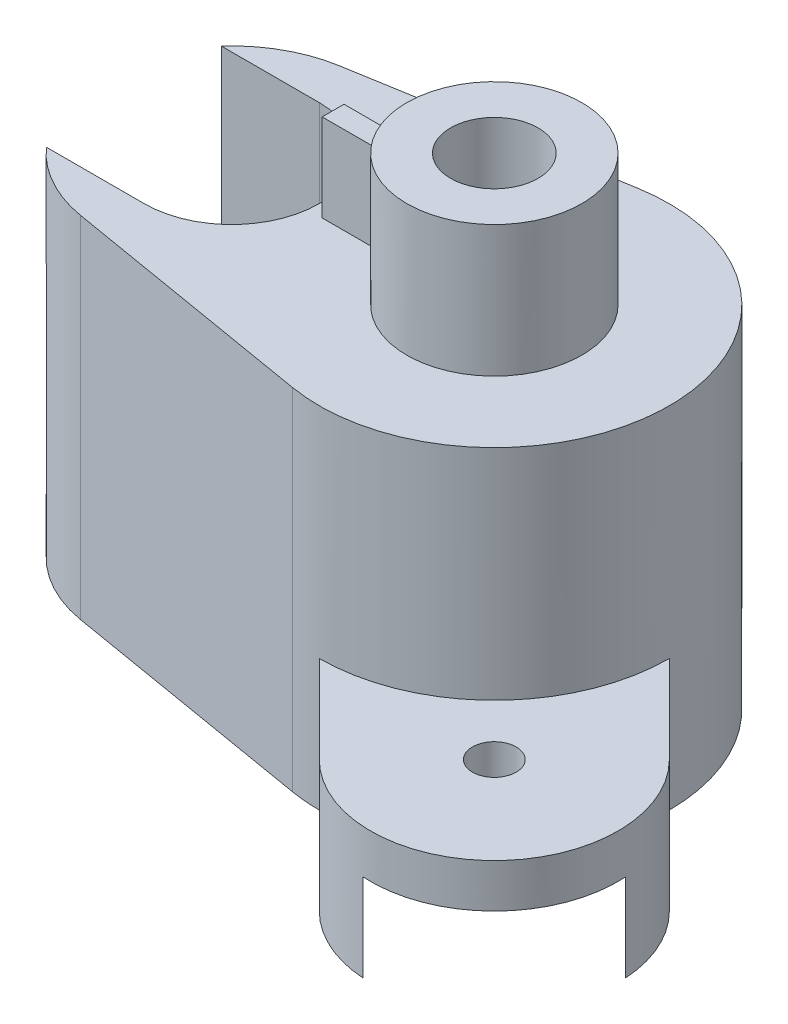
ISO-10303-21;
HEADER;
FILE_DESCRIPTION(('STEP AP214'),'2;1');
FILE_NAME('part.step','',(''),(''),'','','');
FILE_SCHEMA(('AUTOMOTIVE_DESIGN { 1 0 10303 214 1 1 1 1 }'));
ENDSEC;
DATA;
#1=APPLICATION_CONTEXT('core data for automotive mechanical design processes');
#2=APPLICATION_PROTOCOL_DEFINITION('international standard','automotive_design',2000,#1);
#3=PRODUCT_CONTEXT('',#1,'mechanical');
#4=PRODUCT('Part','Part','',(#3));
#5=PRODUCT_RELATED_PRODUCT_CATEGORY('part','',(#4));
#6=PRODUCT_DEFINITION_FORMATION('','',#4);
#7=PRODUCT_DEFINITION_CONTEXT('part definition',#1,'design');
#8=PRODUCT_DEFINITION('design','',#6,#7);
#9=PRODUCT_DEFINITION_SHAPE('','',#8);
#10=(LENGTH_UNIT() NAMED_UNIT(*) SI_UNIT(.MILLI.,.METRE.));
#11=(NAMED_UNIT(*) PLANE_ANGLE_UNIT() SI_UNIT($,.RADIAN.));
#12=(NAMED_UNIT(*) SI_UNIT($,.STERADIAN.) SOLID_ANGLE_UNIT());
#13=UNCERTAINTY_MEASURE_WITH_UNIT(LENGTH_MEASURE(1.E-05),#10,'distance_accuracy_value','');
#14=(GEOMETRIC_REPRESENTATION_CONTEXT(3) GLOBAL_UNCERTAINTY_ASSIGNED_CONTEXT((#13)) GLOBAL_UNIT_ASSIGNED_CONTEXT((#10,
#11,#12)) REPRESENTATION_CONTEXT('',''));
#15=CARTESIAN_POINT('',(0.,0.,0.));
#16=DIRECTION('',(0.,0.,1.));
#17=DIRECTION('',(1.,0.,0.));
#18=AXIS2_PLACEMENT_3D('',#15,#16,#17);
#19=CARTESIAN_POINT('',(0.,80.,0.));
#20=DIRECTION('',(0.,1.,0.));
#21=DIRECTION('',(0.,0.,1.));
#22=AXIS2_PLACEMENT_3D('',#19,#20,#21);
#23=PLANE('',#22);
#24=CARTESIAN_POINT('',(-60.,80.,0.));
#25=DIRECTION('',(0.,1.,0.));
#26=DIRECTION('',(0.,0.,1.));
#27=AXIS2_PLACEMENT_3D('',#24,#25,#26);
#28=CIRCLE('',#27,20.);
#29=CARTESIAN_POINT('',(-60.,80.,-20.));
#30=VERTEX_POINT('',#29);
#31=CARTESIAN_POINT('',(-60.,80.,20.));
#32=VERTEX_POINT('',#31);
#33=EDGE_CURVE('E264',#30,#32,#28,.F.);
#34=ORIENTED_EDGE('',*,*,#33,.T.);
#35=DIRECTION('',(-1.,0.,0.));
#36=VECTOR('',#35,1.);
#37=CARTESIAN_POINT('',(0.,80.,20.));
#38=LINE('',#37,#36);
#39=CARTESIAN_POINT('',(-82.3606797749978,80.,20.));
#40=VERTEX_POINT('',#39);
#41=EDGE_CURVE('E276',#32,#40,#38,.T.);
#42=ORIENTED_EDGE('',*,*,#41,.T.);
#43=CARTESIAN_POINT('',(-60.,80.,0.));
#44=DIRECTION('',(0.,1.,0.));
#45=DIRECTION('',(0.,0.,-1.));
#46=AXIS2_PLACEMENT_3D('',#43,#44,#45);
#47=CIRCLE('',#46,29.9999999999999);
#48=CARTESIAN_POINT('',(-65.,80.,29.5803989154981));
#49=VERTEX_POINT('',#48);
#50=EDGE_CURVE('E326',#40,#49,#47,.T.);
#51=ORIENTED_EDGE('',*,*,#50,.T.);
#52=DIRECTION('',(0.986013297183269,0.,0.166666666666667));
#53=VECTOR('',#52,1.);
#54=CARTESIAN_POINT('',(-65.,80.,29.5803989154981));
#55=LINE('',#54,#53);
#56=CARTESIAN_POINT('',(-6.66666666666666,80.,39.4405318873308));
#57=VERTEX_POINT('',#56);
#58=EDGE_CURVE('E330',#49,#57,#55,.T.);
#59=ORIENTED_EDGE('',*,*,#58,.T.);
#60=CARTESIAN_POINT('',(0.,80.,0.));
#61=DIRECTION('',(0.,1.,0.));
#62=DIRECTION('',(0.,0.,1.));
#63=AXIS2_PLACEMENT_3D('',#60,#61,#62);
#64=CIRCLE('',#63,40.);
#65=CARTESIAN_POINT('',(-6.66666666666667,80.,-39.4405318873308));
#66=VERTEX_POINT('',#65);
#67=EDGE_CURVE('E320',#57,#66,#64,.T.);
#68=ORIENTED_EDGE('',*,*,#67,.T.);
#69=DIRECTION('',(-0.986013297183269,0.,0.166666666666667));
#70=VECTOR('',#69,1.);
#71=CARTESIAN_POINT('',(-6.66666666666667,80.,-39.4405318873308));
#72=LINE('',#71,#70);
#73=CARTESIAN_POINT('',(-65.,80.,-29.5803989154981));
#74=VERTEX_POINT('',#73);
#75=EDGE_CURVE('E323',#66,#74,#72,.T.);
#76=ORIENTED_EDGE('',*,*,#75,.T.);
#77=CARTESIAN_POINT('',(-82.3606797749979,80.,-20.));
#78=VERTEX_POINT('',#77);
#79=EDGE_CURVE('E327',#74,#78,#47,.T.);
#80=ORIENTED_EDGE('',*,*,#79,.T.);
#81=DIRECTION('',(-1.,0.,0.));
#82=VECTOR('',#81,1.);
#83=CARTESIAN_POINT('',(0.,80.,-20.));
#84=LINE('',#83,#82);
#85=EDGE_CURVE('E289',#30,#78,#84,.T.);
#86=ORIENTED_EDGE('',*,*,#85,.F.);
#87=EDGE_LOOP('',(#34,#42,#51,#59,#68,#76,#80,#86));
#88=FACE_BOUND('',#87,.T.);
#89=DIRECTION('',(0.,0.,1.));
#90=VECTOR('',#89,1.);
#91=CARTESIAN_POINT('',(-36.8431348329844,80.,-2.5));
#92=LINE('',#91,#90);
#93=CARTESIAN_POINT('',(-36.8431348329844,80.,-2.5));
#94=VERTEX_POINT('',#93);
#95=CARTESIAN_POINT('',(-36.8431348329844,80.,2.5));
#96=VERTEX_POINT('',#95);
#97=EDGE_CURVE('E50',#94,#96,#92,.T.);
#98=ORIENTED_EDGE('',*,*,#97,.F.);
#99=DIRECTION('',(-1.,0.,0.));
#100=VECTOR('',#99,1.);
#101=CARTESIAN_POINT('',(-19.8431348329844,80.,-2.49999999999999));
#102=LINE('',#101,#100);
#103=CARTESIAN_POINT('',(-19.8431348329844,80.,-2.49999999999999));
#104=VERTEX_POINT('',#103);
#105=EDGE_CURVE('E200',#104,#94,#102,.T.);
#106=ORIENTED_EDGE('',*,*,#105,.F.);
#107=CARTESIAN_POINT('',(0.,80.,0.));
#108=DIRECTION('',(0.,1.,0.));
#109=DIRECTION('',(0.,0.,1.));
#110=AXIS2_PLACEMENT_3D('',#107,#108,#109);
#111=CIRCLE('',#110,20.);
#112=CARTESIAN_POINT('',(-19.8431348329844,80.,2.5));
#113=VERTEX_POINT('',#112);
#114=EDGE_CURVE('E177',#113,#104,#111,.T.);
#115=ORIENTED_EDGE('',*,*,#114,.F.);
#116=DIRECTION('',(1.,0.,0.));
#117=VECTOR('',#116,1.);
#118=CARTESIAN_POINT('',(-19.8431348329844,80.,2.5));
#119=LINE('',#118,#117);
#120=EDGE_CURVE('E55',#96,#113,#119,.T.);
#121=ORIENTED_EDGE('',*,*,#120,.F.);
#122=EDGE_LOOP('',(#98,#106,#115,#121));
#123=FACE_BOUND('',#122,.T.);
#124=ADVANCED_FACE('F35',(#88,#123),#23,.T.);
#125=CARTESIAN_POINT('',(0.,110.,0.));
#126=DIRECTION('',(0.,-1.,0.));
#127=DIRECTION('',(0.,0.,-1.));
#128=AXIS2_PLACEMENT_3D('',#125,#126,#127);
#129=CYLINDRICAL_SURFACE('',#128,20.);
#130=CARTESIAN_POINT('',(0.,110.,0.));
#131=DIRECTION('',(0.,1.,0.));
#132=DIRECTION('',(0.,0.,1.));
#133=AXIS2_PLACEMENT_3D('',#130,#131,#132);
#134=CIRCLE('',#133,20.);
#135=CARTESIAN_POINT('',(0.,110.,20.));
#136=VERTEX_POINT('',#135);
#137=EDGE_CURVE('E309',#136,#136,#134,.T.);
#138=ORIENTED_EDGE('',*,*,#137,.F.);
#139=EDGE_LOOP('',(#138));
#140=FACE_BOUND('',#139,.T.);
#141=DIRECTION('',(0.,-1.,0.));
#142=VECTOR('',#141,1.);
#143=CARTESIAN_POINT('',(-19.8431348329844,100.,-2.49999999999999));
#144=LINE('',#143,#142);
#145=CARTESIAN_POINT('',(-19.8431348329844,100.,-2.49999999999999));
#146=VERTEX_POINT('',#145);
#147=EDGE_CURVE('E174',#146,#104,#144,.T.);
#148=ORIENTED_EDGE('',*,*,#147,.F.);
#149=CARTESIAN_POINT('',(0.,100.,0.));
#150=DIRECTION('',(0.,-1.,0.));
#151=DIRECTION('',(0.,0.,-1.));
#152=AXIS2_PLACEMENT_3D('',#149,#150,#151);
#153=CIRCLE('',#152,20.);
#154=CARTESIAN_POINT('',(-19.8431348329844,100.,2.5));
#155=VERTEX_POINT('',#154);
#156=EDGE_CURVE('E11',#155,#146,#153,.T.);
#157=ORIENTED_EDGE('',*,*,#156,.F.);
#158=DIRECTION('',(0.,-1.,0.));
#159=VECTOR('',#158,1.);
#160=CARTESIAN_POINT('',(-19.8431348329844,100.,2.5));
#161=LINE('',#160,#159);
#162=EDGE_CURVE('E199',#155,#113,#161,.T.);
#163=ORIENTED_EDGE('',*,*,#162,.T.);
#164=ORIENTED_EDGE('',*,*,#114,.T.);
#165=EDGE_LOOP('',(#148,#157,#163,#164));
#166=FACE_BOUND('',#165,.T.);
#167=ADVANCED_FACE('F175',(#140,#166),#129,.T.);
#168=CARTESIAN_POINT('',(0.,0.,0.));
#169=DIRECTION('',(0.,1.,0.));
#170=DIRECTION('',(0.,0.,1.));
#171=AXIS2_PLACEMENT_3D('',#168,#169,#170);
#172=PLANE('',#171);
#173=CARTESIAN_POINT('',(-60.,0.,0.));
#174=DIRECTION('',(0.,1.,0.));
#175=DIRECTION('',(0.,0.,1.));
#176=AXIS2_PLACEMENT_3D('',#173,#174,#175);
#177=CIRCLE('',#176,10.);
#178=CARTESIAN_POINT('',(-60.,0.,9.99999999999997));
#179=VERTEX_POINT('',#178);
#180=EDGE_CURVE('E296',#179,#179,#177,.T.);
#181=ORIENTED_EDGE('',*,*,#180,.T.);
#182=EDGE_LOOP('',(#181));
#183=FACE_BOUND('',#182,.T.);
#184=DIRECTION('',(-0.707106781186542,0.,-0.707106781186554));
#185=VECTOR('',#184,1.);
#186=CARTESIAN_POINT('',(15.0000000000002,0.,-15.));
#187=LINE('',#186,#185);
#188=CARTESIAN_POINT('',(68.228756555323,0.,38.2287565553237));
#189=VERTEX_POINT('',#188);
#190=CARTESIAN_POINT('',(30.,0.,0.));
#191=VERTEX_POINT('',#190);
#192=EDGE_CURVE('E180',#189,#191,#187,.T.);
#193=ORIENTED_EDGE('',*,*,#192,.T.);
#194=CARTESIAN_POINT('',(0.,0.,0.));
#195=DIRECTION('',(0.,-1.,0.));
#196=DIRECTION('',(0.,0.,-1.));
#197=AXIS2_PLACEMENT_3D('',#194,#195,#196);
#198=CIRCLE('',#197,30.);
#199=CARTESIAN_POINT('',(0.,0.,30.));
#200=VERTEX_POINT('',#199);
#201=EDGE_CURVE('E312',#200,#191,#198,.T.);
#202=ORIENTED_EDGE('',*,*,#201,.F.);
#203=DIRECTION('',(-0.707106781186541,0.,-0.707106781186554));
#204=VECTOR('',#203,1.);
#205=CARTESIAN_POINT('',(-15.,0.,14.9999999999997));
#206=LINE('',#205,#204);
#207=CARTESIAN_POINT('',(38.2287565553218,0.,68.2287565553225));
#208=VERTEX_POINT('',#207);
#209=EDGE_CURVE('E211',#208,#200,#206,.T.);
#210=ORIENTED_EDGE('',*,*,#209,.F.);
#211=CARTESIAN_POINT('',(40.,0.,39.9999999999996));
#212=DIRECTION('',(0.,-1.,0.));
#213=DIRECTION('',(0.,0.,-1.));
#214=AXIS2_PLACEMENT_3D('',#211,#212,#213);
#215=CIRCLE('',#214,28.2842712474619);
#216=CARTESIAN_POINT('',(20.0000000000001,0.,59.9999999999999));
#217=VERTEX_POINT('',#216);
#218=EDGE_CURVE('E255',#208,#217,#215,.T.);
#219=ORIENTED_EDGE('',*,*,#218,.T.);
#220=DIRECTION('',(0.707106781186551,0.,0.707106781186544));
#221=VECTOR('',#220,1.);
#222=CARTESIAN_POINT('',(-20.,0.,20.0000000000002));
#223=LINE('',#222,#221);
#224=CARTESIAN_POINT('',(0.,0.,40.));
#225=VERTEX_POINT('',#224);
#226=EDGE_CURVE('E244',#225,#217,#223,.T.);
#227=ORIENTED_EDGE('',*,*,#226,.F.);
#228=CARTESIAN_POINT('',(0.,0.,0.));
#229=DIRECTION('',(0.,1.,0.));
#230=DIRECTION('',(0.,0.,1.));
#231=AXIS2_PLACEMENT_3D('',#228,#229,#230);
#232=CIRCLE('',#231,40.);
#233=CARTESIAN_POINT('',(-6.66666666666666,0.,39.4405318873308));
#234=VERTEX_POINT('',#233);
#235=EDGE_CURVE('E324',#234,#225,#232,.T.);
#236=ORIENTED_EDGE('',*,*,#235,.F.);
#237=DIRECTION('',(0.986013297183269,0.,0.166666666666667));
#238=VECTOR('',#237,1.);
#239=CARTESIAN_POINT('',(-65.,0.,29.5803989154981));
#240=LINE('',#239,#238);
#241=CARTESIAN_POINT('',(-65.,0.,29.5803989154981));
#242=VERTEX_POINT('',#241);
#243=EDGE_CURVE('E338',#242,#234,#240,.T.);
#244=ORIENTED_EDGE('',*,*,#243,.F.);
#245=CARTESIAN_POINT('',(-60.,0.,0.));
#246=DIRECTION('',(0.,1.,0.));
#247=DIRECTION('',(0.,0.,1.));
#248=AXIS2_PLACEMENT_3D('',#245,#246,#247);
#249=CIRCLE('',#248,30.);
#250=CARTESIAN_POINT('',(-65.,0.,-29.5803989154981));
#251=VERTEX_POINT('',#250);
#252=EDGE_CURVE('E336',#251,#242,#249,.T.);
#253=ORIENTED_EDGE('',*,*,#252,.F.);
#254=DIRECTION('',(-0.986013297183269,0.,0.166666666666667));
#255=VECTOR('',#254,1.);
#256=CARTESIAN_POINT('',(-6.66666666666667,0.,-39.4405318873308));
#257=LINE('',#256,#255);
#258=CARTESIAN_POINT('',(-6.66666666666667,0.,-39.4405318873308));
#259=VERTEX_POINT('',#258);
#260=EDGE_CURVE('E317',#259,#251,#257,.T.);
#261=ORIENTED_EDGE('',*,*,#260,.F.);
#262=CARTESIAN_POINT('',(40.,0.,0.));
#263=VERTEX_POINT('',#262);
#264=EDGE_CURVE('E341',#263,#259,#232,.T.);
#265=ORIENTED_EDGE('',*,*,#264,.F.);
#266=DIRECTION('',(0.707106781186551,0.,0.707106781186544));
#267=VECTOR('',#266,1.);
#268=CARTESIAN_POINT('',(19.9999999999998,0.,-20.));
#269=LINE('',#268,#267);
#270=CARTESIAN_POINT('',(59.9999999999999,0.,19.9999999999997));
#271=VERTEX_POINT('',#270);
#272=EDGE_CURVE('E239',#263,#271,#269,.T.);
#273=ORIENTED_EDGE('',*,*,#272,.T.);
#274=EDGE_CURVE('E256',#271,#189,#215,.T.);
#275=ORIENTED_EDGE('',*,*,#274,.T.);
#276=EDGE_LOOP('',(#193,#202,#210,#219,#227,#236,#244,#253,#261,#265,#273,#275));
#277=FACE_BOUND('',#276,.T.);
#278=ADVANCED_FACE('F355',(#183,#277),#172,.F.);
#279=CARTESIAN_POINT('',(0.,30.,0.));
#280=DIRECTION('',(0.,-1.,0.));
#281=DIRECTION('',(0.,0.,-1.));
#282=AXIS2_PLACEMENT_3D('',#279,#280,#281);
#283=CYLINDRICAL_SURFACE('',#282,30.);
#284=CARTESIAN_POINT('',(0.,30.,0.));
#285=DIRECTION('',(0.,-1.,0.));
#286=DIRECTION('',(0.,0.,-1.));
#287=AXIS2_PLACEMENT_3D('',#284,#285,#286);
#288=CIRCLE('',#287,30.);
#289=CARTESIAN_POINT('',(0.,30.,-30.));
#290=VERTEX_POINT('',#289);
#291=EDGE_CURVE('E314',#290,#290,#288,.T.);
#292=ORIENTED_EDGE('',*,*,#291,.F.);
#293=EDGE_LOOP('',(#292));
#294=FACE_BOUND('',#293,.T.);
#295=DIRECTION('',(0.,-1.,0.));
#296=VECTOR('',#295,1.);
#297=CARTESIAN_POINT('',(30.,20.,0.));
#298=LINE('',#297,#296);
#299=CARTESIAN_POINT('',(30.,20.,0.));
#300=VERTEX_POINT('',#299);
#301=EDGE_CURVE('E227',#300,#191,#298,.T.);
#302=ORIENTED_EDGE('',*,*,#301,.F.);
#303=CARTESIAN_POINT('',(0.,20.,0.));
#304=DIRECTION('',(0.,-1.,0.));
#305=DIRECTION('',(0.,0.,-1.));
#306=AXIS2_PLACEMENT_3D('',#303,#304,#305);
#307=CIRCLE('',#306,30.);
#308=CARTESIAN_POINT('',(0.,20.,30.));
#309=VERTEX_POINT('',#308);
#310=EDGE_CURVE('E217',#309,#300,#307,.F.);
#311=ORIENTED_EDGE('',*,*,#310,.F.);
#312=DIRECTION('',(0.,-1.,0.));
#313=VECTOR('',#312,1.);
#314=CARTESIAN_POINT('',(0.,20.,30.));
#315=LINE('',#314,#313);
#316=EDGE_CURVE('E230',#309,#200,#315,.T.);
#317=ORIENTED_EDGE('',*,*,#316,.T.);
#318=ORIENTED_EDGE('',*,*,#201,.T.);
#319=EDGE_LOOP('',(#302,#311,#317,#318));
#320=FACE_BOUND('',#319,.T.);
#321=ADVANCED_FACE('F393',(#294,#320),#283,.F.);
#322=CARTESIAN_POINT('',(40.,30.,39.9999999999996));
#323=DIRECTION('',(0.,-1.,0.));
#324=DIRECTION('',(0.,0.,-1.));
#325=AXIS2_PLACEMENT_3D('',#322,#323,#324);
#326=CYLINDRICAL_SURFACE('',#325,28.2842712474619);
#327=CARTESIAN_POINT('',(40.,20.,39.9999999999996));
#328=DIRECTION('',(0.,-1.,0.));
#329=DIRECTION('',(0.,0.,-1.));
#330=AXIS2_PLACEMENT_3D('',#327,#328,#329);
#331=CIRCLE('',#330,28.2842712474619);
#332=CARTESIAN_POINT('',(68.228756555323,20.,38.2287565553237));
#333=VERTEX_POINT('',#332);
#334=CARTESIAN_POINT('',(38.2287565553218,20.,68.2287565553225));
#335=VERTEX_POINT('',#334);
#336=EDGE_CURVE('E210',#333,#335,#331,.T.);
#337=ORIENTED_EDGE('',*,*,#336,.F.);
#338=DIRECTION('',(0.,-1.,0.));
#339=VECTOR('',#338,1.);
#340=CARTESIAN_POINT('',(68.228756555323,20.,38.2287565553237));
#341=LINE('',#340,#339);
#342=EDGE_CURVE('E223',#333,#189,#341,.T.);
#343=ORIENTED_EDGE('',*,*,#342,.T.);
#344=ORIENTED_EDGE('',*,*,#274,.F.);
#345=DIRECTION('',(0.,-1.,0.));
#346=VECTOR('',#345,1.);
#347=CARTESIAN_POINT('',(59.9999999999999,30.,19.9999999999997));
#348=LINE('',#347,#346);
#349=CARTESIAN_POINT('',(59.9999999999999,30.,19.9999999999997));
#350=VERTEX_POINT('',#349);
#351=EDGE_CURVE('E252',#350,#271,#348,.T.);
#352=ORIENTED_EDGE('',*,*,#351,.F.);
#353=CARTESIAN_POINT('',(40.,30.,39.9999999999996));
#354=DIRECTION('',(0.,-1.,0.));
#355=DIRECTION('',(0.,0.,-1.));
#356=AXIS2_PLACEMENT_3D('',#353,#354,#355);
#357=CIRCLE('',#356,28.2842712474619);
#358=CARTESIAN_POINT('',(20.0000000000001,30.,59.9999999999999));
#359=VERTEX_POINT('',#358);
#360=EDGE_CURVE('E243',#350,#359,#357,.T.);
#361=ORIENTED_EDGE('',*,*,#360,.T.);
#362=DIRECTION('',(0.,-1.,0.));
#363=VECTOR('',#362,1.);
#364=CARTESIAN_POINT('',(20.0000000000001,30.,59.9999999999999));
#365=LINE('',#364,#363);
#366=EDGE_CURVE('E268',#359,#217,#365,.T.);
#367=ORIENTED_EDGE('',*,*,#366,.T.);
#368=ORIENTED_EDGE('',*,*,#218,.F.);
#369=DIRECTION('',(0.,-1.,0.));
#370=VECTOR('',#369,1.);
#371=CARTESIAN_POINT('',(38.2287565553218,20.,68.2287565553225));
#372=LINE('',#371,#370);
#373=EDGE_CURVE('E233',#335,#208,#372,.T.);
#374=ORIENTED_EDGE('',*,*,#373,.F.);
#375=EDGE_LOOP('',(#337,#343,#344,#352,#361,#367,#368,#374));
#376=FACE_BOUND('',#375,.T.);
#377=ADVANCED_FACE('F411',(#376),#326,.T.);
#378=CARTESIAN_POINT('',(40.,30.,39.9999999999996));
#379=DIRECTION('',(0.,-1.,0.));
#380=DIRECTION('',(0.,0.,-1.));
#381=AXIS2_PLACEMENT_3D('',#378,#379,#380);
#382=CYLINDRICAL_SURFACE('',#381,5.);
#383=CARTESIAN_POINT('',(40.,30.,39.9999999999996));
#384=DIRECTION('',(0.,-1.,0.));
#385=DIRECTION('',(0.,0.,-1.));
#386=AXIS2_PLACEMENT_3D('',#383,#384,#385);
#387=CIRCLE('',#386,5.);
#388=CARTESIAN_POINT('',(40.,30.,34.9999999999996));
#389=VERTEX_POINT('',#388);
#390=EDGE_CURVE('E229',#389,#389,#387,.T.);
#391=ORIENTED_EDGE('',*,*,#390,.F.);
#392=EDGE_LOOP('',(#391));
#393=FACE_BOUND('',#392,.T.);
#394=CARTESIAN_POINT('',(40.,20.,39.9999999999996));
#395=DIRECTION('',(0.,-1.,0.));
#396=DIRECTION('',(0.,0.,-1.));
#397=AXIS2_PLACEMENT_3D('',#394,#395,#396);
#398=CIRCLE('',#397,5.);
#399=CARTESIAN_POINT('',(40.,20.,34.9999999999996));
#400=VERTEX_POINT('',#399);
#401=EDGE_CURVE('E220',#400,#400,#398,.F.);
#402=ORIENTED_EDGE('',*,*,#401,.F.);
#403=EDGE_LOOP('',(#402));
#404=FACE_BOUND('',#403,.T.);
#405=ADVANCED_FACE('F406',(#393,#404),#382,.F.);
#406=CARTESIAN_POINT('',(-60.,80.,0.));
#407=DIRECTION('',(0.,-1.,0.));
#408=DIRECTION('',(0.,0.,-1.));
#409=AXIS2_PLACEMENT_3D('',#406,#407,#408);
#410=CYLINDRICAL_SURFACE('',#409,30.);
#411=DIRECTION('',(0.,1.,0.));
#412=VECTOR('',#411,1.);
#413=CARTESIAN_POINT('',(-82.3606797749978,20.,20.));
#414=LINE('',#413,#412);
#415=CARTESIAN_POINT('',(-82.3606797749978,20.,20.));
#416=VERTEX_POINT('',#415);
#417=EDGE_CURVE('E297',#416,#40,#414,.T.);
#418=ORIENTED_EDGE('',*,*,#417,.F.);
#419=CARTESIAN_POINT('',(-60.,20.,0.));
#420=DIRECTION('',(0.,1.,0.));
#421=DIRECTION('',(0.,0.,1.));
#422=AXIS2_PLACEMENT_3D('',#419,#420,#421);
#423=CIRCLE('',#422,29.9999999999999);
#424=CARTESIAN_POINT('',(-82.3606797749979,20.,-20.));
#425=VERTEX_POINT('',#424);
#426=EDGE_CURVE('E278',#425,#416,#423,.T.);
#427=ORIENTED_EDGE('',*,*,#426,.F.);
#428=DIRECTION('',(0.,1.,0.));
#429=VECTOR('',#428,1.);
#430=CARTESIAN_POINT('',(-82.3606797749979,20.,-20.));
#431=LINE('',#430,#429);
#432=EDGE_CURVE('E299',#425,#78,#431,.T.);
#433=ORIENTED_EDGE('',*,*,#432,.T.);
#434=ORIENTED_EDGE('',*,*,#79,.F.);
#435=DIRECTION('',(0.,-1.,0.));
#436=VECTOR('',#435,1.);
#437=CARTESIAN_POINT('',(-65.,80.,-29.5803989154981));
#438=LINE('',#437,#436);
#439=EDGE_CURVE('E348',#74,#251,#438,.T.);
#440=ORIENTED_EDGE('',*,*,#439,.T.);
#441=ORIENTED_EDGE('',*,*,#252,.T.);
#442=DIRECTION('',(0.,-1.,0.));
#443=VECTOR('',#442,1.);
#444=CARTESIAN_POINT('',(-65.,80.,29.5803989154981));
#445=LINE('',#444,#443);
#446=EDGE_CURVE('E345',#49,#242,#445,.T.);
#447=ORIENTED_EDGE('',*,*,#446,.F.);
#448=ORIENTED_EDGE('',*,*,#50,.F.);
#449=EDGE_LOOP('',(#418,#427,#433,#434,#440,#441,#447,#448));
#450=FACE_BOUND('',#449,.T.);
#451=ADVANCED_FACE('F361',(#450),#410,.T.);
#452=CARTESIAN_POINT('',(-60.,-29.,0.));
#453=DIRECTION('',(0.,1.,0.));
#454=DIRECTION('',(0.,0.,1.));
#455=AXIS2_PLACEMENT_3D('',#452,#453,#454);
#456=CYLINDRICAL_SURFACE('',#455,10.);
#457=ORIENTED_EDGE('',*,*,#180,.F.);
#458=EDGE_LOOP('',(#457));
#459=FACE_BOUND('',#458,.T.);
#460=CARTESIAN_POINT('',(-60.,20.,0.));
#461=DIRECTION('',(0.,1.,0.));
#462=DIRECTION('',(0.,0.,1.));
#463=AXIS2_PLACEMENT_3D('',#460,#461,#462);
#464=CIRCLE('',#463,10.);
#465=CARTESIAN_POINT('',(-60.,20.,9.99999999999997));
#466=VERTEX_POINT('',#465);
#467=EDGE_CURVE('E283',#466,#466,#464,.F.);
#468=ORIENTED_EDGE('',*,*,#467,.F.);
#469=EDGE_LOOP('',(#468));
#470=FACE_BOUND('',#469,.T.);
#471=ADVANCED_FACE('F358',(#459,#470),#456,.F.);
#472=CARTESIAN_POINT('',(-6.66666666666667,80.,-39.4405318873308));
#473=DIRECTION('',(0.166666666666667,0.,0.986013297183269));
#474=DIRECTION('',(0.986013297183269,0.,-0.166666666666667));
#475=AXIS2_PLACEMENT_3D('',#472,#473,#474);
#476=PLANE('',#475);
#477=ORIENTED_EDGE('',*,*,#260,.T.);
#478=ORIENTED_EDGE('',*,*,#439,.F.);
#479=ORIENTED_EDGE('',*,*,#75,.F.);
#480=DIRECTION('',(0.,-1.,0.));
#481=VECTOR('',#480,1.);
#482=CARTESIAN_POINT('',(-6.66666666666667,80.,-39.4405318873308));
#483=LINE('',#482,#481);
#484=EDGE_CURVE('E43',#66,#259,#483,.T.);
#485=ORIENTED_EDGE('',*,*,#484,.T.);
#486=EDGE_LOOP('',(#477,#478,#479,#485));
#487=FACE_BOUND('',#486,.T.);
#488=ADVANCED_FACE('F37',(#487),#476,.F.);
#489=CARTESIAN_POINT('',(-65.,80.,29.5803989154981));
#490=DIRECTION('',(0.166666666666667,0.,-0.986013297183269));
#491=DIRECTION('',(-0.98601329718327,0.,-0.166666666666667));
#492=AXIS2_PLACEMENT_3D('',#489,#490,#491);
#493=PLANE('',#492);
#494=ORIENTED_EDGE('',*,*,#243,.T.);
#495=DIRECTION('',(0.,-1.,0.));
#496=VECTOR('',#495,1.);
#497=CARTESIAN_POINT('',(-6.66666666666666,80.,39.4405318873308));
#498=LINE('',#497,#496);
#499=EDGE_CURVE('E333',#57,#234,#498,.T.);
#500=ORIENTED_EDGE('',*,*,#499,.F.);
#501=ORIENTED_EDGE('',*,*,#58,.F.);
#502=ORIENTED_EDGE('',*,*,#446,.T.);
#503=EDGE_LOOP('',(#494,#500,#501,#502));
#504=FACE_BOUND('',#503,.T.);
#505=ADVANCED_FACE('F401',(#504),#493,.F.);
#506=CARTESIAN_POINT('',(0.,80.,0.));
#507=DIRECTION('',(0.,-1.,0.));
#508=DIRECTION('',(0.,0.,-1.));
#509=AXIS2_PLACEMENT_3D('',#506,#507,#508);
#510=CYLINDRICAL_SURFACE('',#509,40.);
#511=CARTESIAN_POINT('',(0.,30.,0.));
#512=DIRECTION('',(0.,-1.,0.));
#513=DIRECTION('',(0.,0.,-1.));
#514=AXIS2_PLACEMENT_3D('',#511,#512,#513);
#515=CIRCLE('',#514,40.);
#516=CARTESIAN_POINT('',(40.,30.,0.));
#517=VERTEX_POINT('',#516);
#518=CARTESIAN_POINT('',(0.,30.,40.));
#519=VERTEX_POINT('',#518);
#520=EDGE_CURVE('E249',#517,#519,#515,.T.);
#521=ORIENTED_EDGE('',*,*,#520,.F.);
#522=DIRECTION('',(0.,-1.,0.));
#523=VECTOR('',#522,1.);
#524=CARTESIAN_POINT('',(40.,30.,0.));
#525=LINE('',#524,#523);
#526=EDGE_CURVE('E261',#517,#263,#525,.T.);
#527=ORIENTED_EDGE('',*,*,#526,.T.);
#528=ORIENTED_EDGE('',*,*,#264,.T.);
#529=ORIENTED_EDGE('',*,*,#484,.F.);
#530=ORIENTED_EDGE('',*,*,#67,.F.);
#531=ORIENTED_EDGE('',*,*,#499,.T.);
#532=ORIENTED_EDGE('',*,*,#235,.T.);
#533=DIRECTION('',(0.,-1.,0.));
#534=VECTOR('',#533,1.);
#535=CARTESIAN_POINT('',(0.,30.,40.));
#536=LINE('',#535,#534);
#537=EDGE_CURVE('E265',#519,#225,#536,.T.);
#538=ORIENTED_EDGE('',*,*,#537,.F.);
#539=EDGE_LOOP('',(#521,#527,#528,#529,#530,#531,#532,#538));
#540=FACE_BOUND('',#539,.T.);
#541=ADVANCED_FACE('F397',(#540),#510,.T.);
#542=CARTESIAN_POINT('',(0.,30.,0.));
#543=DIRECTION('',(0.,-1.,0.));
#544=DIRECTION('',(0.,0.,-1.));
#545=AXIS2_PLACEMENT_3D('',#542,#543,#544);
#546=PLANE('',#545);
#547=ORIENTED_EDGE('',*,*,#291,.T.);
#548=EDGE_LOOP('',(#547));
#549=FACE_BOUND('',#548,.T.);
#550=ADVANCED_FACE('F400',(#549),#546,.T.);
#551=CARTESIAN_POINT('',(0.,110.,0.));
#552=DIRECTION('',(0.,1.,0.));
#553=DIRECTION('',(0.,0.,1.));
#554=AXIS2_PLACEMENT_3D('',#551,#552,#553);
#555=PLANE('',#554);
#556=CARTESIAN_POINT('',(0.,110.,0.));
#557=DIRECTION('',(0.,1.,0.));
#558=DIRECTION('',(0.,0.,1.));
#559=AXIS2_PLACEMENT_3D('',#556,#557,#558);
#560=CIRCLE('',#559,9.99999999999999);
#561=CARTESIAN_POINT('',(0.,110.,9.99999999999999));
#562=VERTEX_POINT('',#561);
#563=EDGE_CURVE('E303',#562,#562,#560,.T.);
#564=ORIENTED_EDGE('',*,*,#563,.F.);
#565=EDGE_LOOP('',(#564));
#566=FACE_BOUND('',#565,.T.);
#567=ORIENTED_EDGE('',*,*,#137,.T.);
#568=EDGE_LOOP('',(#567));
#569=FACE_BOUND('',#568,.T.);
#570=ADVANCED_FACE('F492',(#566,#569),#555,.T.);
#571=CARTESIAN_POINT('',(0.,80.,0.));
#572=DIRECTION('',(0.,1.,0.));
#573=DIRECTION('',(0.,0.,1.));
#574=AXIS2_PLACEMENT_3D('',#571,#572,#573);
#575=CONICAL_SURFACE('',#574,9.99999999999998,1.02974425867665);
#576=CARTESIAN_POINT('',(0.,73.9913938097244,0.));
#577=VERTEX_POINT('',#576);
#578=VERTEX_LOOP('',#577);
#579=FACE_BOUND('',#578,.T.);
#580=CARTESIAN_POINT('',(0.,80.,0.));
#581=DIRECTION('',(0.,1.,0.));
#582=DIRECTION('',(0.,0.,1.));
#583=AXIS2_PLACEMENT_3D('',#580,#581,#582);
#584=CIRCLE('',#583,9.99999999999998);
#585=CARTESIAN_POINT('',(0.,80.,9.99999999999998));
#586=VERTEX_POINT('',#585);
#587=EDGE_CURVE('E306',#586,#586,#584,.T.);
#588=ORIENTED_EDGE('',*,*,#587,.T.);
#589=EDGE_LOOP('',(#588));
#590=FACE_BOUND('',#589,.T.);
#591=ADVANCED_FACE('F496',(#579,#590),#575,.F.);
#592=CARTESIAN_POINT('',(0.,110.,0.));
#593=DIRECTION('',(0.,1.,0.));
#594=DIRECTION('',(0.,0.,1.));
#595=AXIS2_PLACEMENT_3D('',#592,#593,#594);
#596=CYLINDRICAL_SURFACE('',#595,9.99999999999999);
#597=ORIENTED_EDGE('',*,*,#587,.F.);
#598=EDGE_LOOP('',(#597));
#599=FACE_BOUND('',#598,.T.);
#600=ORIENTED_EDGE('',*,*,#563,.T.);
#601=EDGE_LOOP('',(#600));
#602=FACE_BOUND('',#601,.T.);
#603=ADVANCED_FACE('F502',(#599,#602),#596,.F.);
#604=CARTESIAN_POINT('',(-60.,20.,0.));
#605=DIRECTION('',(0.,1.,0.));
#606=DIRECTION('',(0.,0.,1.));
#607=AXIS2_PLACEMENT_3D('',#604,#605,#606);
#608=CYLINDRICAL_SURFACE('',#607,20.);
#609=ORIENTED_EDGE('',*,*,#33,.F.);
#610=DIRECTION('',(0.,1.,0.));
#611=VECTOR('',#610,1.);
#612=CARTESIAN_POINT('',(-60.,20.,-20.));
#613=LINE('',#612,#611);
#614=CARTESIAN_POINT('',(-60.,20.,-20.));
#615=VERTEX_POINT('',#614);
#616=EDGE_CURVE('E286',#615,#30,#613,.T.);
#617=ORIENTED_EDGE('',*,*,#616,.F.);
#618=CARTESIAN_POINT('',(-60.,20.,0.));
#619=DIRECTION('',(0.,1.,0.));
#620=DIRECTION('',(0.,0.,1.));
#621=AXIS2_PLACEMENT_3D('',#618,#619,#620);
#622=CIRCLE('',#621,20.);
#623=CARTESIAN_POINT('',(-60.,20.,20.));
#624=VERTEX_POINT('',#623);
#625=EDGE_CURVE('E272',#615,#624,#622,.F.);
#626=ORIENTED_EDGE('',*,*,#625,.T.);
#627=DIRECTION('',(0.,1.,0.));
#628=VECTOR('',#627,1.);
#629=CARTESIAN_POINT('',(-60.,20.,20.));
#630=LINE('',#629,#628);
#631=EDGE_CURVE('E293',#624,#32,#630,.T.);
#632=ORIENTED_EDGE('',*,*,#631,.T.);
#633=EDGE_LOOP('',(#609,#617,#626,#632));
#634=FACE_BOUND('',#633,.T.);
#635=ADVANCED_FACE('F423',(#634),#608,.F.);
#636=CARTESIAN_POINT('',(0.,20.,20.));
#637=DIRECTION('',(0.,0.,-1.));
#638=DIRECTION('',(-1.,0.,0.));
#639=AXIS2_PLACEMENT_3D('',#636,#637,#638);
#640=PLANE('',#639);
#641=ORIENTED_EDGE('',*,*,#41,.F.);
#642=ORIENTED_EDGE('',*,*,#631,.F.);
#643=DIRECTION('',(-1.,0.,0.));
#644=VECTOR('',#643,1.);
#645=CARTESIAN_POINT('',(0.,20.,20.));
#646=LINE('',#645,#644);
#647=EDGE_CURVE('E281',#624,#416,#646,.T.);
#648=ORIENTED_EDGE('',*,*,#647,.T.);
#649=ORIENTED_EDGE('',*,*,#417,.T.);
#650=EDGE_LOOP('',(#641,#642,#648,#649));
#651=FACE_BOUND('',#650,.T.);
#652=ADVANCED_FACE('F378',(#651),#640,.T.);
#653=CARTESIAN_POINT('',(0.,20.,-20.));
#654=DIRECTION('',(0.,0.,-1.));
#655=DIRECTION('',(-1.,0.,0.));
#656=AXIS2_PLACEMENT_3D('',#653,#654,#655);
#657=PLANE('',#656);
#658=ORIENTED_EDGE('',*,*,#85,.T.);
#659=ORIENTED_EDGE('',*,*,#432,.F.);
#660=DIRECTION('',(-1.,0.,0.));
#661=VECTOR('',#660,1.);
#662=CARTESIAN_POINT('',(0.,20.,-20.));
#663=LINE('',#662,#661);
#664=EDGE_CURVE('E275',#615,#425,#663,.T.);
#665=ORIENTED_EDGE('',*,*,#664,.F.);
#666=ORIENTED_EDGE('',*,*,#616,.T.);
#667=EDGE_LOOP('',(#658,#659,#665,#666));
#668=FACE_BOUND('',#667,.T.);
#669=ADVANCED_FACE('F368',(#668),#657,.F.);
#670=CARTESIAN_POINT('',(0.,20.,0.));
#671=DIRECTION('',(0.,1.,0.));
#672=DIRECTION('',(0.,0.,1.));
#673=AXIS2_PLACEMENT_3D('',#670,#671,#672);
#674=PLANE('',#673);
#675=ORIENTED_EDGE('',*,*,#625,.F.);
#676=ORIENTED_EDGE('',*,*,#664,.T.);
#677=ORIENTED_EDGE('',*,*,#426,.T.);
#678=ORIENTED_EDGE('',*,*,#647,.F.);
#679=EDGE_LOOP('',(#675,#676,#677,#678));
#680=FACE_BOUND('',#679,.T.);
#681=ORIENTED_EDGE('',*,*,#467,.T.);
#682=EDGE_LOOP('',(#681));
#683=FACE_BOUND('',#682,.T.);
#684=ADVANCED_FACE('F365',(#680,#683),#674,.T.);
#685=CARTESIAN_POINT('',(19.9999999999998,30.,-20.));
#686=DIRECTION('',(0.707106781186544,0.,-0.707106781186551));
#687=DIRECTION('',(-0.707106781186551,0.,-0.707106781186544));
#688=AXIS2_PLACEMENT_3D('',#685,#686,#687);
#689=PLANE('',#688);
#690=ORIENTED_EDGE('',*,*,#272,.F.);
#691=ORIENTED_EDGE('',*,*,#526,.F.);
#692=DIRECTION('',(0.707106781186551,0.,0.707106781186544));
#693=VECTOR('',#692,1.);
#694=CARTESIAN_POINT('',(19.9999999999998,30.,-20.));
#695=LINE('',#694,#693);
#696=EDGE_CURVE('E240',#517,#350,#695,.T.);
#697=ORIENTED_EDGE('',*,*,#696,.T.);
#698=ORIENTED_EDGE('',*,*,#351,.T.);
#699=EDGE_LOOP('',(#690,#691,#697,#698));
#700=FACE_BOUND('',#699,.T.);
#701=ADVANCED_FACE('F367',(#700),#689,.T.);
#702=CARTESIAN_POINT('',(-20.,30.,20.0000000000002));
#703=DIRECTION('',(0.707106781186544,0.,-0.707106781186551));
#704=DIRECTION('',(-0.707106781186551,0.,-0.707106781186544));
#705=AXIS2_PLACEMENT_3D('',#702,#703,#704);
#706=PLANE('',#705);
#707=ORIENTED_EDGE('',*,*,#226,.T.);
#708=ORIENTED_EDGE('',*,*,#366,.F.);
#709=DIRECTION('',(0.707106781186551,0.,0.707106781186544));
#710=VECTOR('',#709,1.);
#711=CARTESIAN_POINT('',(-20.,30.,20.0000000000002));
#712=LINE('',#711,#710);
#713=EDGE_CURVE('E247',#519,#359,#712,.T.);
#714=ORIENTED_EDGE('',*,*,#713,.F.);
#715=ORIENTED_EDGE('',*,*,#537,.T.);
#716=EDGE_LOOP('',(#707,#708,#714,#715));
#717=FACE_BOUND('',#716,.T.);
#718=ADVANCED_FACE('F375',(#717),#706,.F.);
#719=CARTESIAN_POINT('',(0.,30.,0.));
#720=DIRECTION('',(0.,-1.,0.));
#721=DIRECTION('',(0.,0.,-1.));
#722=AXIS2_PLACEMENT_3D('',#719,#720,#721);
#723=PLANE('',#722);
#724=ORIENTED_EDGE('',*,*,#390,.T.);
#725=EDGE_LOOP('',(#724));
#726=FACE_BOUND('',#725,.T.);
#727=ORIENTED_EDGE('',*,*,#696,.F.);
#728=ORIENTED_EDGE('',*,*,#520,.T.);
#729=ORIENTED_EDGE('',*,*,#713,.T.);
#730=ORIENTED_EDGE('',*,*,#360,.F.);
#731=EDGE_LOOP('',(#727,#728,#729,#730));
#732=FACE_BOUND('',#731,.T.);
#733=ADVANCED_FACE('F441',(#726,#732),#723,.F.);
#734=CARTESIAN_POINT('',(15.0000000000002,20.,-15.));
#735=DIRECTION('',(-0.707106781186554,0.,0.707106781186542));
#736=DIRECTION('',(0.707106781186542,0.,0.707106781186554));
#737=AXIS2_PLACEMENT_3D('',#734,#735,#736);
#738=PLANE('',#737);
#739=ORIENTED_EDGE('',*,*,#192,.F.);
#740=ORIENTED_EDGE('',*,*,#342,.F.);
#741=DIRECTION('',(-0.707106781186542,0.,-0.707106781186554));
#742=VECTOR('',#741,1.);
#743=CARTESIAN_POINT('',(15.0000000000002,20.,-15.));
#744=LINE('',#743,#742);
#745=EDGE_CURVE('E208',#333,#300,#744,.T.);
#746=ORIENTED_EDGE('',*,*,#745,.T.);
#747=ORIENTED_EDGE('',*,*,#301,.T.);
#748=EDGE_LOOP('',(#739,#740,#746,#747));
#749=FACE_BOUND('',#748,.T.);
#750=ADVANCED_FACE('F451',(#749),#738,.T.);
#751=CARTESIAN_POINT('',(-15.,20.,14.9999999999997));
#752=DIRECTION('',(-0.707106781186554,0.,0.707106781186541));
#753=DIRECTION('',(0.707106781186541,0.,0.707106781186554));
#754=AXIS2_PLACEMENT_3D('',#751,#752,#753);
#755=PLANE('',#754);
#756=ORIENTED_EDGE('',*,*,#209,.T.);
#757=ORIENTED_EDGE('',*,*,#316,.F.);
#758=DIRECTION('',(-0.707106781186541,0.,-0.707106781186554));
#759=VECTOR('',#758,1.);
#760=CARTESIAN_POINT('',(-15.,20.,14.9999999999997));
#761=LINE('',#760,#759);
#762=EDGE_CURVE('E214',#335,#309,#761,.T.);
#763=ORIENTED_EDGE('',*,*,#762,.F.);
#764=ORIENTED_EDGE('',*,*,#373,.T.);
#765=EDGE_LOOP('',(#756,#757,#763,#764));
#766=FACE_BOUND('',#765,.T.);
#767=ADVANCED_FACE('F458',(#766),#755,.F.);
#768=CARTESIAN_POINT('',(0.,20.,0.));
#769=DIRECTION('',(0.,-1.,0.));
#770=DIRECTION('',(0.,0.,-1.));
#771=AXIS2_PLACEMENT_3D('',#768,#769,#770);
#772=PLANE('',#771);
#773=ORIENTED_EDGE('',*,*,#745,.F.);
#774=ORIENTED_EDGE('',*,*,#336,.T.);
#775=ORIENTED_EDGE('',*,*,#762,.T.);
#776=ORIENTED_EDGE('',*,*,#310,.T.);
#777=EDGE_LOOP('',(#773,#774,#775,#776));
#778=FACE_BOUND('',#777,.T.);
#779=ORIENTED_EDGE('',*,*,#401,.T.);
#780=EDGE_LOOP('',(#779));
#781=FACE_BOUND('',#780,.T.);
#782=ADVANCED_FACE('F460',(#778,#781),#772,.T.);
#783=CARTESIAN_POINT('',(0.,100.,0.));
#784=DIRECTION('',(0.,-1.,0.));
#785=DIRECTION('',(0.,0.,-1.));
#786=AXIS2_PLACEMENT_3D('',#783,#784,#785);
#787=PLANE('',#786);
#788=DIRECTION('',(1.,0.,0.));
#789=VECTOR('',#788,1.);
#790=CARTESIAN_POINT('',(-19.8431348329844,100.,2.5));
#791=LINE('',#790,#789);
#792=CARTESIAN_POINT('',(-36.8431348329844,100.,2.5));
#793=VERTEX_POINT('',#792);
#794=EDGE_CURVE('E188',#793,#155,#791,.T.);
#795=ORIENTED_EDGE('',*,*,#794,.T.);
#796=ORIENTED_EDGE('',*,*,#156,.T.);
#797=DIRECTION('',(-1.,0.,0.));
#798=VECTOR('',#797,1.);
#799=CARTESIAN_POINT('',(-19.8431348329844,100.,-2.49999999999999));
#800=LINE('',#799,#798);
#801=CARTESIAN_POINT('',(-36.8431348329844,100.,-2.5));
#802=VERTEX_POINT('',#801);
#803=EDGE_CURVE('E185',#146,#802,#800,.T.);
#804=ORIENTED_EDGE('',*,*,#803,.T.);
#805=DIRECTION('',(0.,0.,1.));
#806=VECTOR('',#805,1.);
#807=CARTESIAN_POINT('',(-36.8431348329844,100.,-2.5));
#808=LINE('',#807,#806);
#809=EDGE_CURVE('E193',#802,#793,#808,.T.);
#810=ORIENTED_EDGE('',*,*,#809,.T.);
#811=EDGE_LOOP('',(#795,#796,#804,#810));
#812=FACE_BOUND('',#811,.T.);
#813=ADVANCED_FACE('F184',(#812),#787,.F.);
#814=CARTESIAN_POINT('',(-19.8431348329844,100.,-2.49999999999999));
#815=DIRECTION('',(0.,0.,1.));
#816=DIRECTION('',(1.,0.,0.));
#817=AXIS2_PLACEMENT_3D('',#814,#815,#816);
#818=PLANE('',#817);
#819=ORIENTED_EDGE('',*,*,#105,.T.);
#820=DIRECTION('',(0.,-1.,0.));
#821=VECTOR('',#820,1.);
#822=CARTESIAN_POINT('',(-36.8431348329844,100.,-2.5));
#823=LINE('',#822,#821);
#824=EDGE_CURVE('E181',#802,#94,#823,.T.);
#825=ORIENTED_EDGE('',*,*,#824,.F.);
#826=ORIENTED_EDGE('',*,*,#803,.F.);
#827=ORIENTED_EDGE('',*,*,#147,.T.);
#828=EDGE_LOOP('',(#819,#825,#826,#827));
#829=FACE_BOUND('',#828,.T.);
#830=ADVANCED_FACE('F190',(#829),#818,.F.);
#831=CARTESIAN_POINT('',(-36.8431348329844,100.,-2.5));
#832=DIRECTION('',(1.,0.,0.));
#833=DIRECTION('',(0.,0.,-1.));
#834=AXIS2_PLACEMENT_3D('',#831,#832,#833);
#835=PLANE('',#834);
#836=ORIENTED_EDGE('',*,*,#97,.T.);
#837=DIRECTION('',(0.,-1.,0.));
#838=VECTOR('',#837,1.);
#839=CARTESIAN_POINT('',(-36.8431348329844,100.,2.5));
#840=LINE('',#839,#838);
#841=EDGE_CURVE('E204',#793,#96,#840,.T.);
#842=ORIENTED_EDGE('',*,*,#841,.F.);
#843=ORIENTED_EDGE('',*,*,#809,.F.);
#844=ORIENTED_EDGE('',*,*,#824,.T.);
#845=EDGE_LOOP('',(#836,#842,#843,#844));
#846=FACE_BOUND('',#845,.T.);
#847=ADVANCED_FACE('F610',(#846),#835,.F.);
#848=CARTESIAN_POINT('',(-19.8431348329844,100.,2.5));
#849=DIRECTION('',(0.,0.,-1.));
#850=DIRECTION('',(-1.,0.,0.));
#851=AXIS2_PLACEMENT_3D('',#848,#849,#850);
#852=PLANE('',#851);
#853=ORIENTED_EDGE('',*,*,#120,.T.);
#854=ORIENTED_EDGE('',*,*,#162,.F.);
#855=ORIENTED_EDGE('',*,*,#794,.F.);
#856=ORIENTED_EDGE('',*,*,#841,.T.);
#857=EDGE_LOOP('',(#853,#854,#855,#856));
#858=FACE_BOUND('',#857,.T.);
#859=ADVANCED_FACE('F618',(#858),#852,.F.);
#860=CLOSED_SHELL('',(#124,#167,#278,#321,#377,#405,#451,#471,#488,#505,#541,#550,#570,#591,
#603,#635,#652,#669,#684,#701,#718,#733,#750,#767,#782,#813,#830,#847,#859));
#861=MANIFOLD_SOLID_BREP('B2',#860);
#862=ADVANCED_BREP_SHAPE_REPRESENTATION('',(#18,#861),#14);
#863=SHAPE_DEFINITION_REPRESENTATION(#9,#862);
ENDSEC;
END-ISO-10303-21;
